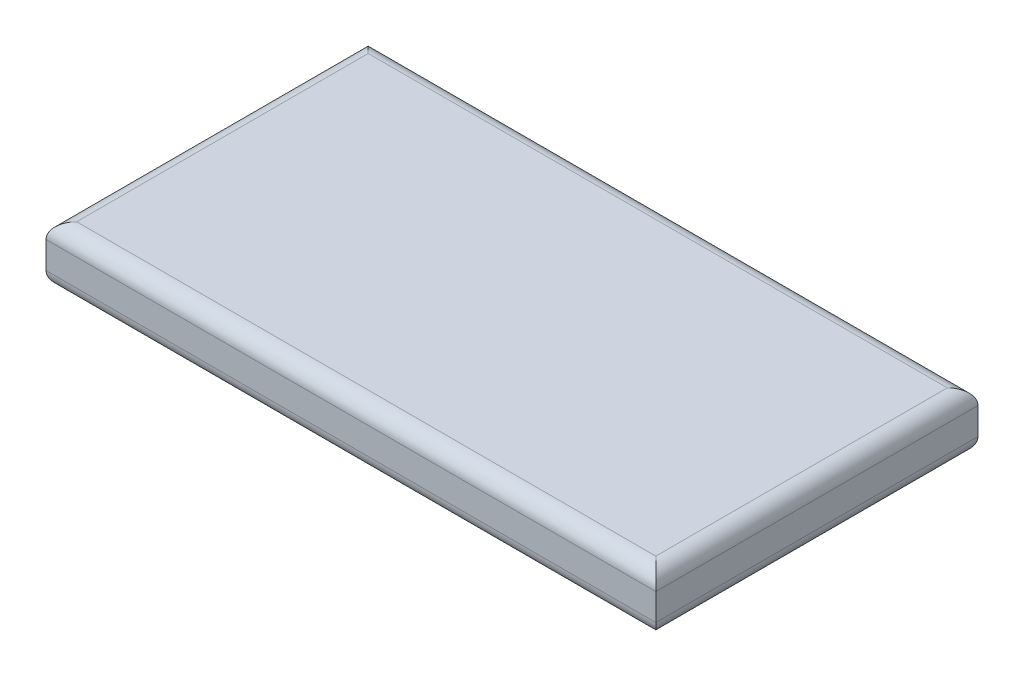
ISO-10303-21;
HEADER;
FILE_DESCRIPTION(('STEP AP214'),'2;1');
FILE_NAME('part.step','',(''),(''),'','','');
FILE_SCHEMA(('AUTOMOTIVE_DESIGN { 1 0 10303 214 1 1 1 1 }'));
ENDSEC;
DATA;
#1=APPLICATION_CONTEXT('core data for automotive mechanical design processes');
#2=APPLICATION_PROTOCOL_DEFINITION('international standard','automotive_design',2000,#1);
#3=PRODUCT_CONTEXT('',#1,'mechanical');
#4=PRODUCT('Part','Part','',(#3));
#5=PRODUCT_RELATED_PRODUCT_CATEGORY('part','',(#4));
#6=PRODUCT_DEFINITION_FORMATION('','',#4);
#7=PRODUCT_DEFINITION_CONTEXT('part definition',#1,'design');
#8=PRODUCT_DEFINITION('design','',#6,#7);
#9=PRODUCT_DEFINITION_SHAPE('','',#8);
#10=(LENGTH_UNIT() NAMED_UNIT(*) SI_UNIT(.MILLI.,.METRE.));
#11=(NAMED_UNIT(*) PLANE_ANGLE_UNIT() SI_UNIT($,.RADIAN.));
#12=(NAMED_UNIT(*) SI_UNIT($,.STERADIAN.) SOLID_ANGLE_UNIT());
#13=UNCERTAINTY_MEASURE_WITH_UNIT(LENGTH_MEASURE(1.E-05),#10,'distance_accuracy_value','');
#14=(GEOMETRIC_REPRESENTATION_CONTEXT(3) GLOBAL_UNCERTAINTY_ASSIGNED_CONTEXT((#13)) GLOBAL_UNIT_ASSIGNED_CONTEXT((#10,
#11,#12)) REPRESENTATION_CONTEXT('',''));
#15=CARTESIAN_POINT('',(0.,0.,0.));
#16=DIRECTION('',(0.,0.,1.));
#17=DIRECTION('',(1.,0.,0.));
#18=AXIS2_PLACEMENT_3D('',#15,#16,#17);
#19=CARTESIAN_POINT('',(79.5,15.,-42.));
#20=DIRECTION('',(-1.,0.,0.));
#21=DIRECTION('',(0.,0.,1.));
#22=AXIS2_PLACEMENT_3D('',#19,#20,#21);
#23=PLANE('',#22);
#24=DIRECTION('',(0.,-1.,0.));
#25=VECTOR('',#24,1.);
#26=CARTESIAN_POINT('',(79.5,15.,-42.));
#27=LINE('',#26,#25);
#28=CARTESIAN_POINT('',(79.5,11.,-42.));
#29=VERTEX_POINT('',#28);
#30=CARTESIAN_POINT('',(79.5,4.,-42.));
#31=VERTEX_POINT('',#30);
#32=EDGE_CURVE('E118',#29,#31,#27,.T.);
#33=ORIENTED_EDGE('',*,*,#32,.F.);
#34=DIRECTION('',(0.,0.,-1.));
#35=VECTOR('',#34,1.);
#36=CARTESIAN_POINT('',(79.5,11.,42.));
#37=LINE('',#36,#35);
#38=CARTESIAN_POINT('',(79.5,11.,42.));
#39=VERTEX_POINT('',#38);
#40=EDGE_CURVE('E142',#29,#39,#37,.F.);
#41=ORIENTED_EDGE('',*,*,#40,.T.);
#42=DIRECTION('',(0.,-1.,0.));
#43=VECTOR('',#42,1.);
#44=CARTESIAN_POINT('',(79.5,15.,42.));
#45=LINE('',#44,#43);
#46=CARTESIAN_POINT('',(79.5,4.,42.));
#47=VERTEX_POINT('',#46);
#48=EDGE_CURVE('E153',#39,#47,#45,.T.);
#49=ORIENTED_EDGE('',*,*,#48,.T.);
#50=DIRECTION('',(0.,0.,-1.));
#51=VECTOR('',#50,1.);
#52=CARTESIAN_POINT('',(79.5,4.,-42.));
#53=LINE('',#52,#51);
#54=EDGE_CURVE('E140',#47,#31,#53,.T.);
#55=ORIENTED_EDGE('',*,*,#54,.T.);
#56=EDGE_LOOP('',(#33,#41,#49,#55));
#57=FACE_BOUND('',#56,.T.);
#58=ADVANCED_FACE('F33',(#57),#23,.F.);
#59=CARTESIAN_POINT('',(-79.5,15.,-42.));
#60=DIRECTION('',(0.,0.,1.));
#61=DIRECTION('',(1.,0.,0.));
#62=AXIS2_PLACEMENT_3D('',#59,#60,#61);
#63=PLANE('',#62);
#64=DIRECTION('',(0.,-1.,0.));
#65=VECTOR('',#64,1.);
#66=CARTESIAN_POINT('',(-79.5,15.,-42.));
#67=LINE('',#66,#65);
#68=CARTESIAN_POINT('',(-79.5,11.,-42.));
#69=VERTEX_POINT('',#68);
#70=CARTESIAN_POINT('',(-79.5,4.,-42.));
#71=VERTEX_POINT('',#70);
#72=EDGE_CURVE('E280',#69,#71,#67,.T.);
#73=ORIENTED_EDGE('',*,*,#72,.F.);
#74=DIRECTION('',(-1.,0.,0.));
#75=VECTOR('',#74,1.);
#76=CARTESIAN_POINT('',(79.5,11.,-42.));
#77=LINE('',#76,#75);
#78=EDGE_CURVE('E138',#69,#29,#77,.F.);
#79=ORIENTED_EDGE('',*,*,#78,.T.);
#80=ORIENTED_EDGE('',*,*,#32,.T.);
#81=DIRECTION('',(-1.,0.,0.));
#82=VECTOR('',#81,1.);
#83=CARTESIAN_POINT('',(-79.5,4.,-42.));
#84=LINE('',#83,#82);
#85=EDGE_CURVE('E135',#31,#71,#84,.T.);
#86=ORIENTED_EDGE('',*,*,#85,.T.);
#87=EDGE_LOOP('',(#73,#79,#80,#86));
#88=FACE_BOUND('',#87,.T.);
#89=ADVANCED_FACE('F190',(#88),#63,.F.);
#90=CARTESIAN_POINT('',(-79.5,15.,-42.));
#91=DIRECTION('',(1.,0.,0.));
#92=DIRECTION('',(0.,0.,-1.));
#93=AXIS2_PLACEMENT_3D('',#90,#91,#92);
#94=PLANE('',#93);
#95=DIRECTION('',(0.,-1.,0.));
#96=VECTOR('',#95,1.);
#97=CARTESIAN_POINT('',(-79.5,15.,42.));
#98=LINE('',#97,#96);
#99=CARTESIAN_POINT('',(-79.5,11.,42.));
#100=VERTEX_POINT('',#99);
#101=CARTESIAN_POINT('',(-79.5,4.,42.));
#102=VERTEX_POINT('',#101);
#103=EDGE_CURVE('E276',#100,#102,#98,.T.);
#104=ORIENTED_EDGE('',*,*,#103,.F.);
#105=DIRECTION('',(0.,0.,1.));
#106=VECTOR('',#105,1.);
#107=CARTESIAN_POINT('',(-79.5,11.,-42.));
#108=LINE('',#107,#106);
#109=EDGE_CURVE('E133',#100,#69,#108,.F.);
#110=ORIENTED_EDGE('',*,*,#109,.T.);
#111=ORIENTED_EDGE('',*,*,#72,.T.);
#112=DIRECTION('',(0.,0.,1.));
#113=VECTOR('',#112,1.);
#114=CARTESIAN_POINT('',(-79.5,4.,-42.));
#115=LINE('',#114,#113);
#116=EDGE_CURVE('E131',#71,#102,#115,.T.);
#117=ORIENTED_EDGE('',*,*,#116,.T.);
#118=EDGE_LOOP('',(#104,#110,#111,#117));
#119=FACE_BOUND('',#118,.T.);
#120=ADVANCED_FACE('F196',(#119),#94,.F.);
#121=CARTESIAN_POINT('',(-79.5,15.,42.));
#122=DIRECTION('',(0.,0.,-1.));
#123=DIRECTION('',(-1.,0.,0.));
#124=AXIS2_PLACEMENT_3D('',#121,#122,#123);
#125=PLANE('',#124);
#126=ORIENTED_EDGE('',*,*,#48,.F.);
#127=DIRECTION('',(1.,0.,0.));
#128=VECTOR('',#127,1.);
#129=CARTESIAN_POINT('',(-79.5,11.,42.));
#130=LINE('',#129,#128);
#131=EDGE_CURVE('E105',#39,#100,#130,.F.);
#132=ORIENTED_EDGE('',*,*,#131,.T.);
#133=ORIENTED_EDGE('',*,*,#103,.T.);
#134=DIRECTION('',(1.,0.,0.));
#135=VECTOR('',#134,1.);
#136=CARTESIAN_POINT('',(-79.5,4.,42.));
#137=LINE('',#136,#135);
#138=EDGE_CURVE('E124',#102,#47,#137,.T.);
#139=ORIENTED_EDGE('',*,*,#138,.T.);
#140=EDGE_LOOP('',(#126,#132,#133,#139));
#141=FACE_BOUND('',#140,.T.);
#142=ADVANCED_FACE('F186',(#141),#125,.F.);
#143=CARTESIAN_POINT('',(0.,15.,0.));
#144=DIRECTION('',(0.,1.,0.));
#145=DIRECTION('',(0.,0.,1.));
#146=AXIS2_PLACEMENT_3D('',#143,#144,#145);
#147=PLANE('',#146);
#148=DIRECTION('',(0.,0.,1.));
#149=VECTOR('',#148,1.);
#150=CARTESIAN_POINT('',(-75.5,15.,42.));
#151=LINE('',#150,#149);
#152=CARTESIAN_POINT('',(-75.5,15.,-38.));
#153=VERTEX_POINT('',#152);
#154=CARTESIAN_POINT('',(-75.5,15.,38.));
#155=VERTEX_POINT('',#154);
#156=EDGE_CURVE('E122',#153,#155,#151,.T.);
#157=ORIENTED_EDGE('',*,*,#156,.T.);
#158=DIRECTION('',(1.,0.,0.));
#159=VECTOR('',#158,1.);
#160=CARTESIAN_POINT('',(79.5,15.,38.));
#161=LINE('',#160,#159);
#162=CARTESIAN_POINT('',(75.5,15.,38.));
#163=VERTEX_POINT('',#162);
#164=EDGE_CURVE('E103',#155,#163,#161,.T.);
#165=ORIENTED_EDGE('',*,*,#164,.T.);
#166=DIRECTION('',(0.,0.,-1.));
#167=VECTOR('',#166,1.);
#168=CARTESIAN_POINT('',(75.5,15.,-42.));
#169=LINE('',#168,#167);
#170=CARTESIAN_POINT('',(75.5,15.,-38.));
#171=VERTEX_POINT('',#170);
#172=EDGE_CURVE('E111',#163,#171,#169,.T.);
#173=ORIENTED_EDGE('',*,*,#172,.T.);
#174=DIRECTION('',(-1.,0.,0.));
#175=VECTOR('',#174,1.);
#176=CARTESIAN_POINT('',(-79.5,15.,-38.));
#177=LINE('',#176,#175);
#178=EDGE_CURVE('E117',#171,#153,#177,.T.);
#179=ORIENTED_EDGE('',*,*,#178,.T.);
#180=EDGE_LOOP('',(#157,#165,#173,#179));
#181=FACE_BOUND('',#180,.T.);
#182=ADVANCED_FACE('F120',(#181),#147,.T.);
#183=CARTESIAN_POINT('',(0.,0.,0.));
#184=DIRECTION('',(0.,1.,0.));
#185=DIRECTION('',(0.,0.,1.));
#186=AXIS2_PLACEMENT_3D('',#183,#184,#185);
#187=PLANE('',#186);
#188=DIRECTION('',(0.,0.,1.));
#189=VECTOR('',#188,1.);
#190=CARTESIAN_POINT('',(-75.5,0.,0.));
#191=LINE('',#190,#189);
#192=CARTESIAN_POINT('',(-75.5,0.,38.));
#193=VERTEX_POINT('',#192);
#194=CARTESIAN_POINT('',(-75.5,0.,-38.));
#195=VERTEX_POINT('',#194);
#196=EDGE_CURVE('E42',#193,#195,#191,.F.);
#197=ORIENTED_EDGE('',*,*,#196,.T.);
#198=DIRECTION('',(-1.,0.,0.));
#199=VECTOR('',#198,1.);
#200=CARTESIAN_POINT('',(0.,0.,-38.));
#201=LINE('',#200,#199);
#202=CARTESIAN_POINT('',(75.5,0.,-38.));
#203=VERTEX_POINT('',#202);
#204=EDGE_CURVE('E11',#195,#203,#201,.F.);
#205=ORIENTED_EDGE('',*,*,#204,.T.);
#206=DIRECTION('',(0.,0.,-1.));
#207=VECTOR('',#206,1.);
#208=CARTESIAN_POINT('',(75.5,0.,0.));
#209=LINE('',#208,#207);
#210=CARTESIAN_POINT('',(75.5,0.,38.));
#211=VERTEX_POINT('',#210);
#212=EDGE_CURVE('E144',#203,#211,#209,.F.);
#213=ORIENTED_EDGE('',*,*,#212,.T.);
#214=DIRECTION('',(1.,0.,0.));
#215=VECTOR('',#214,1.);
#216=CARTESIAN_POINT('',(0.,0.,38.));
#217=LINE('',#216,#215);
#218=EDGE_CURVE('E53',#211,#193,#217,.F.);
#219=ORIENTED_EDGE('',*,*,#218,.T.);
#220=EDGE_LOOP('',(#197,#205,#213,#219));
#221=FACE_BOUND('',#220,.T.);
#222=ADVANCED_FACE('F175',(#221),#187,.F.);
#223=CARTESIAN_POINT('',(0.,11.,-38.));
#224=DIRECTION('',(1.,0.,0.));
#225=DIRECTION('',(0.,0.,-1.));
#226=AXIS2_PLACEMENT_3D('',#223,#224,#225);
#227=CYLINDRICAL_SURFACE('',#226,4.);
#228=CARTESIAN_POINT('',(75.5,11.,-38.));
#229=DIRECTION('',(0.707106781186547,0.,0.707106781186548));
#230=DIRECTION('',(-0.707106781186548,0.,0.707106781186547));
#231=AXIS2_PLACEMENT_3D('',#228,#229,#230);
#232=ELLIPSE('',#231,5.65685424949238,4.);
#233=EDGE_CURVE('E114',#29,#171,#232,.T.);
#234=ORIENTED_EDGE('',*,*,#233,.F.);
#235=ORIENTED_EDGE('',*,*,#78,.F.);
#236=CARTESIAN_POINT('',(-75.5,11.,-38.));
#237=DIRECTION('',(0.707106781186547,0.,-0.707106781186547));
#238=DIRECTION('',(0.707106781186547,0.,0.707106781186547));
#239=AXIS2_PLACEMENT_3D('',#236,#237,#238);
#240=ELLIPSE('',#239,5.65685424949238,4.);
#241=EDGE_CURVE('E150',#153,#69,#240,.F.);
#242=ORIENTED_EDGE('',*,*,#241,.F.);
#243=ORIENTED_EDGE('',*,*,#178,.F.);
#244=EDGE_LOOP('',(#234,#235,#242,#243));
#245=FACE_BOUND('',#244,.T.);
#246=ADVANCED_FACE('F177',(#245),#227,.T.);
#247=CARTESIAN_POINT('',(-75.5,11.,0.));
#248=DIRECTION('',(0.,0.,-1.));
#249=DIRECTION('',(-1.,0.,0.));
#250=AXIS2_PLACEMENT_3D('',#247,#248,#249);
#251=CYLINDRICAL_SURFACE('',#250,4.);
#252=ORIENTED_EDGE('',*,*,#241,.T.);
#253=ORIENTED_EDGE('',*,*,#109,.F.);
#254=CARTESIAN_POINT('',(-75.5,11.,38.));
#255=DIRECTION('',(-0.707106781186547,0.,-0.707106781186547));
#256=DIRECTION('',(0.707106781186547,0.,-0.707106781186547));
#257=AXIS2_PLACEMENT_3D('',#254,#255,#256);
#258=ELLIPSE('',#257,5.65685424949238,4.);
#259=EDGE_CURVE('E108',#155,#100,#258,.F.);
#260=ORIENTED_EDGE('',*,*,#259,.F.);
#261=ORIENTED_EDGE('',*,*,#156,.F.);
#262=EDGE_LOOP('',(#252,#253,#260,#261));
#263=FACE_BOUND('',#262,.T.);
#264=ADVANCED_FACE('F183',(#263),#251,.T.);
#265=CARTESIAN_POINT('',(75.5,11.,0.));
#266=DIRECTION('',(0.,0.,1.));
#267=DIRECTION('',(1.,0.,0.));
#268=AXIS2_PLACEMENT_3D('',#265,#266,#267);
#269=CYLINDRICAL_SURFACE('',#268,4.);
#270=ORIENTED_EDGE('',*,*,#233,.T.);
#271=ORIENTED_EDGE('',*,*,#172,.F.);
#272=CARTESIAN_POINT('',(75.5,11.,38.));
#273=DIRECTION('',(-0.707106781186548,0.,0.707106781186547));
#274=DIRECTION('',(0.707106781186547,0.,0.707106781186548));
#275=AXIS2_PLACEMENT_3D('',#272,#273,#274);
#276=ELLIPSE('',#275,5.65685424949238,4.);
#277=EDGE_CURVE('E99',#39,#163,#276,.T.);
#278=ORIENTED_EDGE('',*,*,#277,.F.);
#279=ORIENTED_EDGE('',*,*,#40,.F.);
#280=EDGE_LOOP('',(#270,#271,#278,#279));
#281=FACE_BOUND('',#280,.T.);
#282=ADVANCED_FACE('F112',(#281),#269,.T.);
#283=CARTESIAN_POINT('',(0.,11.,38.));
#284=DIRECTION('',(-1.,0.,0.));
#285=DIRECTION('',(0.,0.,1.));
#286=AXIS2_PLACEMENT_3D('',#283,#284,#285);
#287=CYLINDRICAL_SURFACE('',#286,4.);
#288=ORIENTED_EDGE('',*,*,#259,.T.);
#289=ORIENTED_EDGE('',*,*,#131,.F.);
#290=ORIENTED_EDGE('',*,*,#277,.T.);
#291=ORIENTED_EDGE('',*,*,#164,.F.);
#292=EDGE_LOOP('',(#288,#289,#290,#291));
#293=FACE_BOUND('',#292,.T.);
#294=ADVANCED_FACE('F101',(#293),#287,.T.);
#295=CARTESIAN_POINT('',(-79.5,4.,38.));
#296=DIRECTION('',(1.,0.,0.));
#297=DIRECTION('',(0.,0.,-1.));
#298=AXIS2_PLACEMENT_3D('',#295,#296,#297);
#299=CYLINDRICAL_SURFACE('',#298,4.);
#300=CARTESIAN_POINT('',(-75.5,4.,38.));
#301=DIRECTION('',(0.707106781186547,0.,0.707106781186547));
#302=DIRECTION('',(0.707106781186547,0.,-0.707106781186547));
#303=AXIS2_PLACEMENT_3D('',#300,#301,#302);
#304=ELLIPSE('',#303,5.65685424949238,4.);
#305=EDGE_CURVE('E157',#193,#102,#304,.F.);
#306=ORIENTED_EDGE('',*,*,#305,.F.);
#307=ORIENTED_EDGE('',*,*,#218,.F.);
#308=CARTESIAN_POINT('',(75.5,4.,38.));
#309=DIRECTION('',(0.707106781186548,0.,-0.707106781186547));
#310=DIRECTION('',(-0.707106781186547,0.,-0.707106781186548));
#311=AXIS2_PLACEMENT_3D('',#308,#309,#310);
#312=ELLIPSE('',#311,5.65685424949238,4.);
#313=EDGE_CURVE('E37',#47,#211,#312,.T.);
#314=ORIENTED_EDGE('',*,*,#313,.F.);
#315=ORIENTED_EDGE('',*,*,#138,.F.);
#316=EDGE_LOOP('',(#306,#307,#314,#315));
#317=FACE_BOUND('',#316,.T.);
#318=ADVANCED_FACE('F35',(#317),#299,.T.);
#319=CARTESIAN_POINT('',(75.5,4.,-42.));
#320=DIRECTION('',(0.,0.,-1.));
#321=DIRECTION('',(-1.,0.,0.));
#322=AXIS2_PLACEMENT_3D('',#319,#320,#321);
#323=CYLINDRICAL_SURFACE('',#322,4.);
#324=ORIENTED_EDGE('',*,*,#313,.T.);
#325=ORIENTED_EDGE('',*,*,#212,.F.);
#326=CARTESIAN_POINT('',(75.5,4.,-38.));
#327=DIRECTION('',(-0.707106781186547,0.,-0.707106781186548));
#328=DIRECTION('',(0.707106781186548,0.,-0.707106781186547));
#329=AXIS2_PLACEMENT_3D('',#326,#327,#328);
#330=ELLIPSE('',#329,5.65685424949238,4.);
#331=EDGE_CURVE('E156',#31,#203,#330,.T.);
#332=ORIENTED_EDGE('',*,*,#331,.F.);
#333=ORIENTED_EDGE('',*,*,#54,.F.);
#334=EDGE_LOOP('',(#324,#325,#332,#333));
#335=FACE_BOUND('',#334,.T.);
#336=ADVANCED_FACE('F166',(#335),#323,.T.);
#337=CARTESIAN_POINT('',(-75.5,4.,-42.));
#338=DIRECTION('',(0.,0.,1.));
#339=DIRECTION('',(1.,0.,0.));
#340=AXIS2_PLACEMENT_3D('',#337,#338,#339);
#341=CYLINDRICAL_SURFACE('',#340,4.);
#342=ORIENTED_EDGE('',*,*,#305,.T.);
#343=ORIENTED_EDGE('',*,*,#116,.F.);
#344=CARTESIAN_POINT('',(-75.5,4.,-38.));
#345=DIRECTION('',(-0.707106781186547,0.,0.707106781186547));
#346=DIRECTION('',(0.707106781186547,0.,0.707106781186547));
#347=AXIS2_PLACEMENT_3D('',#344,#345,#346);
#348=ELLIPSE('',#347,5.65685424949238,4.);
#349=EDGE_CURVE('E154',#195,#71,#348,.F.);
#350=ORIENTED_EDGE('',*,*,#349,.F.);
#351=ORIENTED_EDGE('',*,*,#196,.F.);
#352=EDGE_LOOP('',(#342,#343,#350,#351));
#353=FACE_BOUND('',#352,.T.);
#354=ADVANCED_FACE('F171',(#353),#341,.T.);
#355=CARTESIAN_POINT('',(-79.5,4.,-38.));
#356=DIRECTION('',(-1.,0.,0.));
#357=DIRECTION('',(0.,0.,1.));
#358=AXIS2_PLACEMENT_3D('',#355,#356,#357);
#359=CYLINDRICAL_SURFACE('',#358,4.);
#360=ORIENTED_EDGE('',*,*,#331,.T.);
#361=ORIENTED_EDGE('',*,*,#204,.F.);
#362=ORIENTED_EDGE('',*,*,#349,.T.);
#363=ORIENTED_EDGE('',*,*,#85,.F.);
#364=EDGE_LOOP('',(#360,#361,#362,#363));
#365=FACE_BOUND('',#364,.T.);
#366=ADVANCED_FACE('F174',(#365),#359,.T.);
#367=CLOSED_SHELL('',(#58,#89,#120,#142,#182,#222,#246,#264,#282,#294,#318,#336,#354,#366));
#368=MANIFOLD_SOLID_BREP('B2',#367);
#369=ADVANCED_BREP_SHAPE_REPRESENTATION('',(#18,#368),#14);
#370=SHAPE_DEFINITION_REPRESENTATION(#9,#369);
ENDSEC;
END-ISO-10303-21;
